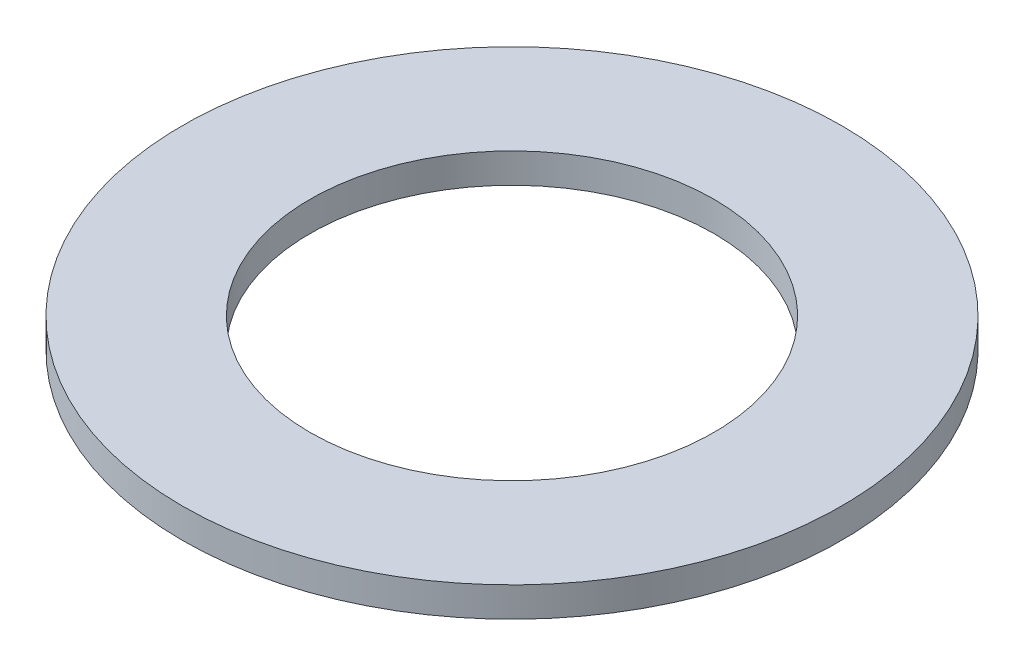
ISO-10303-21;
HEADER;
FILE_DESCRIPTION(('STEP AP214'),'2;1');
FILE_NAME('part.step','',(''),(''),'','','');
FILE_SCHEMA(('AUTOMOTIVE_DESIGN { 1 0 10303 214 1 1 1 1 }'));
ENDSEC;
DATA;
#1=APPLICATION_CONTEXT('core data for automotive mechanical design processes');
#2=APPLICATION_PROTOCOL_DEFINITION('international standard','automotive_design',2000,#1);
#3=PRODUCT_CONTEXT('',#1,'mechanical');
#4=PRODUCT('Part','Part','',(#3));
#5=PRODUCT_RELATED_PRODUCT_CATEGORY('part','',(#4));
#6=PRODUCT_DEFINITION_FORMATION('','',#4);
#7=PRODUCT_DEFINITION_CONTEXT('part definition',#1,'design');
#8=PRODUCT_DEFINITION('design','',#6,#7);
#9=PRODUCT_DEFINITION_SHAPE('','',#8);
#10=(LENGTH_UNIT() NAMED_UNIT(*) SI_UNIT(.MILLI.,.METRE.));
#11=(NAMED_UNIT(*) PLANE_ANGLE_UNIT() SI_UNIT($,.RADIAN.));
#12=(NAMED_UNIT(*) SI_UNIT($,.STERADIAN.) SOLID_ANGLE_UNIT());
#13=UNCERTAINTY_MEASURE_WITH_UNIT(LENGTH_MEASURE(1.E-05),#10,'distance_accuracy_value','');
#14=(GEOMETRIC_REPRESENTATION_CONTEXT(3) GLOBAL_UNCERTAINTY_ASSIGNED_CONTEXT((#13)) GLOBAL_UNIT_ASSIGNED_CONTEXT((#10,
#11,#12)) REPRESENTATION_CONTEXT('',''));
#15=CARTESIAN_POINT('',(0.,0.,0.));
#16=DIRECTION('',(0.,0.,1.));
#17=DIRECTION('',(1.,0.,0.));
#18=AXIS2_PLACEMENT_3D('',#15,#16,#17);
#19=CARTESIAN_POINT('',(0.,7.,0.));
#20=DIRECTION('',(0.,-1.,0.));
#21=DIRECTION('',(0.,0.,-1.));
#22=AXIS2_PLACEMENT_3D('',#19,#20,#21);
#23=CYLINDRICAL_SURFACE('',#22,77.5);
#24=CARTESIAN_POINT('',(0.,7.,0.));
#25=DIRECTION('',(0.,1.,0.));
#26=DIRECTION('',(0.,0.,1.));
#27=AXIS2_PLACEMENT_3D('',#24,#25,#26);
#28=CIRCLE('',#27,77.5);
#29=CARTESIAN_POINT('',(0.,7.,77.5));
#30=VERTEX_POINT('',#29);
#31=EDGE_CURVE('E10',#30,#30,#28,.T.);
#32=ORIENTED_EDGE('',*,*,#31,.F.);
#33=EDGE_LOOP('',(#32));
#34=FACE_BOUND('',#33,.T.);
#35=CARTESIAN_POINT('',(0.,0.,0.));
#36=DIRECTION('',(0.,1.,0.));
#37=DIRECTION('',(0.,0.,1.));
#38=AXIS2_PLACEMENT_3D('',#35,#36,#37);
#39=CIRCLE('',#38,77.5);
#40=CARTESIAN_POINT('',(0.,0.,77.5));
#41=VERTEX_POINT('',#40);
#42=EDGE_CURVE('E37',#41,#41,#39,.T.);
#43=ORIENTED_EDGE('',*,*,#42,.T.);
#44=EDGE_LOOP('',(#43));
#45=FACE_BOUND('',#44,.T.);
#46=ADVANCED_FACE('F40',(#34,#45),#23,.T.);
#47=CARTESIAN_POINT('',(0.,7.,0.));
#48=DIRECTION('',(0.,1.,0.));
#49=DIRECTION('',(0.,0.,1.));
#50=AXIS2_PLACEMENT_3D('',#47,#48,#49);
#51=PLANE('',#50);
#52=CARTESIAN_POINT('',(0.,7.,0.));
#53=DIRECTION('',(0.,1.,0.));
#54=DIRECTION('',(0.,0.,1.));
#55=AXIS2_PLACEMENT_3D('',#52,#53,#54);
#56=CIRCLE('',#55,47.5);
#57=CARTESIAN_POINT('',(0.,7.,47.5));
#58=VERTEX_POINT('',#57);
#59=EDGE_CURVE('E50',#58,#58,#56,.T.);
#60=ORIENTED_EDGE('',*,*,#59,.F.);
#61=EDGE_LOOP('',(#60));
#62=FACE_BOUND('',#61,.T.);
#63=ORIENTED_EDGE('',*,*,#31,.T.);
#64=EDGE_LOOP('',(#63));
#65=FACE_BOUND('',#64,.T.);
#66=ADVANCED_FACE('F59',(#62,#65),#51,.T.);
#67=CARTESIAN_POINT('',(0.,0.,0.));
#68=DIRECTION('',(0.,1.,0.));
#69=DIRECTION('',(0.,0.,1.));
#70=AXIS2_PLACEMENT_3D('',#67,#68,#69);
#71=PLANE('',#70);
#72=CARTESIAN_POINT('',(0.,0.,0.));
#73=DIRECTION('',(0.,1.,0.));
#74=DIRECTION('',(0.,0.,1.));
#75=AXIS2_PLACEMENT_3D('',#72,#73,#74);
#76=CIRCLE('',#75,47.5);
#77=CARTESIAN_POINT('',(0.,0.,47.5));
#78=VERTEX_POINT('',#77);
#79=EDGE_CURVE('E47',#78,#78,#76,.T.);
#80=ORIENTED_EDGE('',*,*,#79,.T.);
#81=EDGE_LOOP('',(#80));
#82=FACE_BOUND('',#81,.T.);
#83=ORIENTED_EDGE('',*,*,#42,.F.);
#84=EDGE_LOOP('',(#83));
#85=FACE_BOUND('',#84,.T.);
#86=ADVANCED_FACE('F58',(#82,#85),#71,.F.);
#87=CARTESIAN_POINT('',(0.,7.,0.));
#88=DIRECTION('',(0.,-1.,0.));
#89=DIRECTION('',(0.,0.,-1.));
#90=AXIS2_PLACEMENT_3D('',#87,#88,#89);
#91=CYLINDRICAL_SURFACE('',#90,47.5);
#92=ORIENTED_EDGE('',*,*,#59,.T.);
#93=EDGE_LOOP('',(#92));
#94=FACE_BOUND('',#93,.T.);
#95=ORIENTED_EDGE('',*,*,#79,.F.);
#96=EDGE_LOOP('',(#95));
#97=FACE_BOUND('',#96,.T.);
#98=ADVANCED_FACE('F54',(#94,#97),#91,.F.);
#99=CLOSED_SHELL('',(#46,#66,#86,#98));
#100=MANIFOLD_SOLID_BREP('B2',#99);
#101=ADVANCED_BREP_SHAPE_REPRESENTATION('',(#18,#100),#14);
#102=SHAPE_DEFINITION_REPRESENTATION(#9,#101);
ENDSEC;
END-ISO-10303-21;
